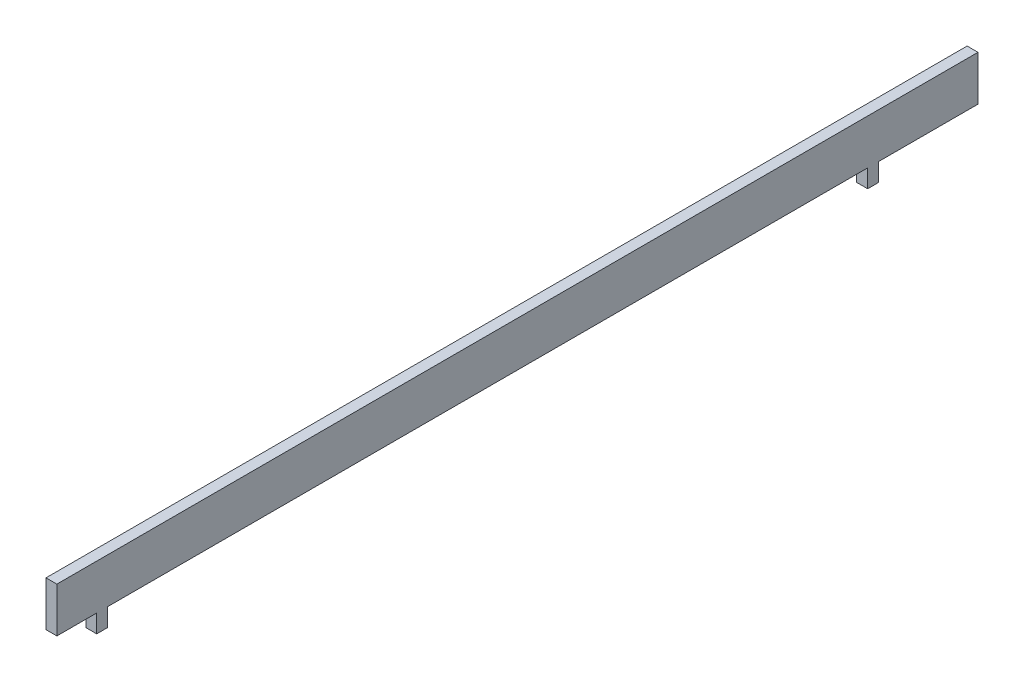
ISO-10303-21;
HEADER;
FILE_DESCRIPTION(('STEP AP214'),'2;1');
FILE_NAME('part.step','',(''),(''),'','','');
FILE_SCHEMA(('AUTOMOTIVE_DESIGN { 1 0 10303 214 1 1 1 1 }'));
ENDSEC;
DATA;
#1=APPLICATION_CONTEXT('core data for automotive mechanical design processes');
#2=APPLICATION_PROTOCOL_DEFINITION('international standard','automotive_design',2000,#1);
#3=PRODUCT_CONTEXT('',#1,'mechanical');
#4=PRODUCT('Part','Part','',(#3));
#5=PRODUCT_RELATED_PRODUCT_CATEGORY('part','',(#4));
#6=PRODUCT_DEFINITION_FORMATION('','',#4);
#7=PRODUCT_DEFINITION_CONTEXT('part definition',#1,'design');
#8=PRODUCT_DEFINITION('design','',#6,#7);
#9=PRODUCT_DEFINITION_SHAPE('','',#8);
#10=(LENGTH_UNIT() NAMED_UNIT(*) SI_UNIT(.MILLI.,.METRE.));
#11=(NAMED_UNIT(*) PLANE_ANGLE_UNIT() SI_UNIT($,.RADIAN.));
#12=(NAMED_UNIT(*) SI_UNIT($,.STERADIAN.) SOLID_ANGLE_UNIT());
#13=UNCERTAINTY_MEASURE_WITH_UNIT(LENGTH_MEASURE(1.E-05),#10,'distance_accuracy_value','');
#14=(GEOMETRIC_REPRESENTATION_CONTEXT(3) GLOBAL_UNCERTAINTY_ASSIGNED_CONTEXT((#13)) GLOBAL_UNIT_ASSIGNED_CONTEXT((#10,
#11,#12)) REPRESENTATION_CONTEXT('',''));
#15=CARTESIAN_POINT('',(0.,0.,0.));
#16=DIRECTION('',(0.,0.,1.));
#17=DIRECTION('',(1.,0.,0.));
#18=AXIS2_PLACEMENT_3D('',#15,#16,#17);
#19=CARTESIAN_POINT('',(1.5,76.,-320.));
#20=DIRECTION('',(0.,0.,-1.));
#21=DIRECTION('',(-1.,0.,0.));
#22=AXIS2_PLACEMENT_3D('',#19,#20,#21);
#23=PLANE('',#22);
#24=CARTESIAN_POINT('',(0.,0.,-320.));
#25=DIRECTION('',(0.,0.,1.));
#26=DIRECTION('',(1.,0.,0.));
#27=AXIS2_PLACEMENT_3D('',#24,#25,#26);
#28=CIRCLE('',#27,83.6);
#29=CARTESIAN_POINT('',(1.5,83.5865419789573,-320.));
#30=VERTEX_POINT('',#29);
#31=CARTESIAN_POINT('',(-1.5,83.5865419789573,-320.));
#32=VERTEX_POINT('',#31);
#33=EDGE_CURVE('E49',#30,#32,#28,.T.);
#34=ORIENTED_EDGE('',*,*,#33,.F.);
#35=DIRECTION('',(0.,-1.,0.));
#36=VECTOR('',#35,1.);
#37=CARTESIAN_POINT('',(1.5,76.,-320.));
#38=LINE('',#37,#36);
#39=CARTESIAN_POINT('',(1.5,96.,-320.));
#40=VERTEX_POINT('',#39);
#41=EDGE_CURVE('E81',#40,#30,#38,.T.);
#42=ORIENTED_EDGE('',*,*,#41,.F.);
#43=DIRECTION('',(-1.,0.,0.));
#44=VECTOR('',#43,1.);
#45=CARTESIAN_POINT('',(1.5,96.,-320.));
#46=LINE('',#45,#44);
#47=CARTESIAN_POINT('',(-1.5,96.,-320.));
#48=VERTEX_POINT('',#47);
#49=EDGE_CURVE('E74',#40,#48,#46,.T.);
#50=ORIENTED_EDGE('',*,*,#49,.T.);
#51=DIRECTION('',(0.,-1.,0.));
#52=VECTOR('',#51,1.);
#53=CARTESIAN_POINT('',(-1.5,76.,-320.));
#54=LINE('',#53,#52);
#55=EDGE_CURVE('E86',#48,#32,#54,.T.);
#56=ORIENTED_EDGE('',*,*,#55,.T.);
#57=EDGE_LOOP('',(#34,#42,#50,#56));
#58=FACE_BOUND('',#57,.T.);
#59=ADVANCED_FACE('F35',(#58),#23,.F.);
#60=CARTESIAN_POINT('',(1.5,76.,-574.5));
#61=DIRECTION('',(0.,0.,1.));
#62=DIRECTION('',(1.,0.,0.));
#63=AXIS2_PLACEMENT_3D('',#60,#61,#62);
#64=PLANE('',#63);
#65=CARTESIAN_POINT('',(0.,0.,-574.5));
#66=DIRECTION('',(0.,0.,1.));
#67=DIRECTION('',(1.,0.,0.));
#68=AXIS2_PLACEMENT_3D('',#65,#66,#67);
#69=CIRCLE('',#68,83.6);
#70=CARTESIAN_POINT('',(1.5,83.5865419789573,-574.5));
#71=VERTEX_POINT('',#70);
#72=CARTESIAN_POINT('',(-1.5,83.5865419789573,-574.5));
#73=VERTEX_POINT('',#72);
#74=EDGE_CURVE('E145',#71,#73,#69,.T.);
#75=ORIENTED_EDGE('',*,*,#74,.T.);
#76=DIRECTION('',(0.,1.,0.));
#77=VECTOR('',#76,1.);
#78=CARTESIAN_POINT('',(-1.5,76.,-574.5));
#79=LINE('',#78,#77);
#80=CARTESIAN_POINT('',(-1.5,96.,-574.5));
#81=VERTEX_POINT('',#80);
#82=EDGE_CURVE('E82',#73,#81,#79,.T.);
#83=ORIENTED_EDGE('',*,*,#82,.T.);
#84=DIRECTION('',(-1.,0.,0.));
#85=VECTOR('',#84,1.);
#86=CARTESIAN_POINT('',(1.5,96.,-574.5));
#87=LINE('',#86,#85);
#88=CARTESIAN_POINT('',(1.5,96.,-574.5));
#89=VERTEX_POINT('',#88);
#90=EDGE_CURVE('E77',#89,#81,#87,.T.);
#91=ORIENTED_EDGE('',*,*,#90,.F.);
#92=DIRECTION('',(0.,1.,0.));
#93=VECTOR('',#92,1.);
#94=CARTESIAN_POINT('',(1.5,76.,-574.5));
#95=LINE('',#94,#93);
#96=EDGE_CURVE('E173',#71,#89,#95,.T.);
#97=ORIENTED_EDGE('',*,*,#96,.F.);
#98=EDGE_LOOP('',(#75,#83,#91,#97));
#99=FACE_BOUND('',#98,.T.);
#100=ADVANCED_FACE('F177',(#99),#64,.F.);
#101=CARTESIAN_POINT('',(1.5,0.,0.));
#102=DIRECTION('',(-1.,0.,0.));
#103=DIRECTION('',(0.,0.,1.));
#104=AXIS2_PLACEMENT_3D('',#101,#102,#103);
#105=PLANE('',#104);
#106=DIRECTION('',(0.,0.,1.));
#107=VECTOR('',#106,1.);
#108=CARTESIAN_POINT('',(1.5,83.5865419789573,0.));
#109=LINE('',#108,#107);
#110=CARTESIAN_POINT('',(1.5,83.5865419789573,-547.));
#111=VERTEX_POINT('',#110);
#112=EDGE_CURVE('E91',#71,#111,#109,.T.);
#113=ORIENTED_EDGE('',*,*,#112,.F.);
#114=ORIENTED_EDGE('',*,*,#96,.T.);
#115=DIRECTION('',(0.,0.,1.));
#116=VECTOR('',#115,1.);
#117=CARTESIAN_POINT('',(1.5,96.,-320.));
#118=LINE('',#117,#116);
#119=EDGE_CURVE('E58',#89,#40,#118,.T.);
#120=ORIENTED_EDGE('',*,*,#119,.T.);
#121=ORIENTED_EDGE('',*,*,#41,.T.);
#122=DIRECTION('',(0.,0.,1.));
#123=VECTOR('',#122,1.);
#124=CARTESIAN_POINT('',(1.5,83.5865419789573,0.));
#125=LINE('',#124,#123);
#126=CARTESIAN_POINT('',(1.5,83.5865419789573,-331.));
#127=VERTEX_POINT('',#126);
#128=EDGE_CURVE('E147',#127,#30,#125,.T.);
#129=ORIENTED_EDGE('',*,*,#128,.F.);
#130=DIRECTION('',(0.,1.,0.));
#131=VECTOR('',#130,1.);
#132=CARTESIAN_POINT('',(1.5,0.,-331.));
#133=LINE('',#132,#131);
#134=CARTESIAN_POINT('',(1.5,78.5856857194744,-331.));
#135=VERTEX_POINT('',#134);
#136=EDGE_CURVE('E154',#135,#127,#133,.T.);
#137=ORIENTED_EDGE('',*,*,#136,.F.);
#138=DIRECTION('',(0.,0.,1.));
#139=VECTOR('',#138,1.);
#140=CARTESIAN_POINT('',(1.5,78.5856857194744,0.));
#141=LINE('',#140,#139);
#142=CARTESIAN_POINT('',(1.5,78.5856857194744,-334.));
#143=VERTEX_POINT('',#142);
#144=EDGE_CURVE('E157',#143,#135,#141,.T.);
#145=ORIENTED_EDGE('',*,*,#144,.F.);
#146=DIRECTION('',(0.,-1.,0.));
#147=VECTOR('',#146,1.);
#148=CARTESIAN_POINT('',(1.5,0.,-334.));
#149=LINE('',#148,#147);
#150=CARTESIAN_POINT('',(1.5,83.5865419789573,-334.));
#151=VERTEX_POINT('',#150);
#152=EDGE_CURVE('E160',#151,#143,#149,.T.);
#153=ORIENTED_EDGE('',*,*,#152,.F.);
#154=DIRECTION('',(0.,0.,1.));
#155=VECTOR('',#154,1.);
#156=CARTESIAN_POINT('',(1.5,83.5865419789573,0.));
#157=LINE('',#156,#155);
#158=CARTESIAN_POINT('',(1.5,83.5865419789573,-544.));
#159=VERTEX_POINT('',#158);
#160=EDGE_CURVE('E163',#159,#151,#157,.T.);
#161=ORIENTED_EDGE('',*,*,#160,.F.);
#162=DIRECTION('',(0.,1.,0.));
#163=VECTOR('',#162,1.);
#164=CARTESIAN_POINT('',(1.5,0.,-544.));
#165=LINE('',#164,#163);
#166=CARTESIAN_POINT('',(1.5,78.5856857194744,-544.));
#167=VERTEX_POINT('',#166);
#168=EDGE_CURVE('E166',#167,#159,#165,.T.);
#169=ORIENTED_EDGE('',*,*,#168,.F.);
#170=DIRECTION('',(0.,0.,1.));
#171=VECTOR('',#170,1.);
#172=CARTESIAN_POINT('',(1.5,78.5856857194744,0.));
#173=LINE('',#172,#171);
#174=CARTESIAN_POINT('',(1.5,78.5856857194744,-547.));
#175=VERTEX_POINT('',#174);
#176=EDGE_CURVE('E169',#175,#167,#173,.T.);
#177=ORIENTED_EDGE('',*,*,#176,.F.);
#178=DIRECTION('',(0.,-1.,0.));
#179=VECTOR('',#178,1.);
#180=CARTESIAN_POINT('',(1.5,0.,-547.));
#181=LINE('',#180,#179);
#182=EDGE_CURVE('E95',#111,#175,#181,.T.);
#183=ORIENTED_EDGE('',*,*,#182,.F.);
#184=EDGE_LOOP('',(#113,#114,#120,#121,#129,#137,#145,#153,#161,#169,#177,#183));
#185=FACE_BOUND('',#184,.T.);
#186=ADVANCED_FACE('F175',(#185),#105,.F.);
#187=CARTESIAN_POINT('',(-1.5,0.,0.));
#188=DIRECTION('',(-1.,0.,0.));
#189=DIRECTION('',(0.,0.,1.));
#190=AXIS2_PLACEMENT_3D('',#187,#188,#189);
#191=PLANE('',#190);
#192=ORIENTED_EDGE('',*,*,#82,.F.);
#193=DIRECTION('',(0.,0.,1.));
#194=VECTOR('',#193,1.);
#195=CARTESIAN_POINT('',(-1.5,83.5865419789573,0.));
#196=LINE('',#195,#194);
#197=CARTESIAN_POINT('',(-1.5,83.5865419789573,-547.));
#198=VERTEX_POINT('',#197);
#199=EDGE_CURVE('E11',#73,#198,#196,.T.);
#200=ORIENTED_EDGE('',*,*,#199,.T.);
#201=DIRECTION('',(0.,-1.,0.));
#202=VECTOR('',#201,1.);
#203=CARTESIAN_POINT('',(-1.5,0.,-547.));
#204=LINE('',#203,#202);
#205=CARTESIAN_POINT('',(-1.5,78.5856857194744,-547.));
#206=VERTEX_POINT('',#205);
#207=EDGE_CURVE('E42',#198,#206,#204,.T.);
#208=ORIENTED_EDGE('',*,*,#207,.T.);
#209=DIRECTION('',(0.,0.,1.));
#210=VECTOR('',#209,1.);
#211=CARTESIAN_POINT('',(-1.5,78.5856857194744,0.));
#212=LINE('',#211,#210);
#213=CARTESIAN_POINT('',(-1.5,78.5856857194744,-544.));
#214=VERTEX_POINT('',#213);
#215=EDGE_CURVE('E116',#206,#214,#212,.T.);
#216=ORIENTED_EDGE('',*,*,#215,.T.);
#217=DIRECTION('',(0.,1.,0.));
#218=VECTOR('',#217,1.);
#219=CARTESIAN_POINT('',(-1.5,0.,-544.));
#220=LINE('',#219,#218);
#221=CARTESIAN_POINT('',(-1.5,83.5865419789573,-544.));
#222=VERTEX_POINT('',#221);
#223=EDGE_CURVE('E113',#214,#222,#220,.T.);
#224=ORIENTED_EDGE('',*,*,#223,.T.);
#225=DIRECTION('',(0.,0.,1.));
#226=VECTOR('',#225,1.);
#227=CARTESIAN_POINT('',(-1.5,83.5865419789573,0.));
#228=LINE('',#227,#226);
#229=CARTESIAN_POINT('',(-1.5,83.5865419789573,-334.));
#230=VERTEX_POINT('',#229);
#231=EDGE_CURVE('E110',#222,#230,#228,.T.);
#232=ORIENTED_EDGE('',*,*,#231,.T.);
#233=DIRECTION('',(0.,-1.,0.));
#234=VECTOR('',#233,1.);
#235=CARTESIAN_POINT('',(-1.5,0.,-334.));
#236=LINE('',#235,#234);
#237=CARTESIAN_POINT('',(-1.5,78.5856857194744,-334.));
#238=VERTEX_POINT('',#237);
#239=EDGE_CURVE('E107',#230,#238,#236,.T.);
#240=ORIENTED_EDGE('',*,*,#239,.T.);
#241=DIRECTION('',(0.,0.,1.));
#242=VECTOR('',#241,1.);
#243=CARTESIAN_POINT('',(-1.5,78.5856857194744,0.));
#244=LINE('',#243,#242);
#245=CARTESIAN_POINT('',(-1.5,78.5856857194744,-331.));
#246=VERTEX_POINT('',#245);
#247=EDGE_CURVE('E104',#238,#246,#244,.T.);
#248=ORIENTED_EDGE('',*,*,#247,.T.);
#249=DIRECTION('',(0.,1.,0.));
#250=VECTOR('',#249,1.);
#251=CARTESIAN_POINT('',(-1.5,0.,-331.));
#252=LINE('',#251,#250);
#253=CARTESIAN_POINT('',(-1.5,83.5865419789573,-331.));
#254=VERTEX_POINT('',#253);
#255=EDGE_CURVE('E102',#246,#254,#252,.T.);
#256=ORIENTED_EDGE('',*,*,#255,.T.);
#257=DIRECTION('',(0.,0.,1.));
#258=VECTOR('',#257,1.);
#259=CARTESIAN_POINT('',(-1.5,83.5865419789573,0.));
#260=LINE('',#259,#258);
#261=EDGE_CURVE('E90',#254,#32,#260,.T.);
#262=ORIENTED_EDGE('',*,*,#261,.T.);
#263=ORIENTED_EDGE('',*,*,#55,.F.);
#264=DIRECTION('',(0.,0.,1.));
#265=VECTOR('',#264,1.);
#266=CARTESIAN_POINT('',(-1.5,96.,-320.));
#267=LINE('',#266,#265);
#268=EDGE_CURVE('E71',#81,#48,#267,.T.);
#269=ORIENTED_EDGE('',*,*,#268,.F.);
#270=EDGE_LOOP('',(#192,#200,#208,#216,#224,#232,#240,#248,#256,#262,#263,#269));
#271=FACE_BOUND('',#270,.T.);
#272=ADVANCED_FACE('F88',(#271),#191,.T.);
#273=CARTESIAN_POINT('',(1.5,96.,-320.));
#274=DIRECTION('',(0.,-1.,0.));
#275=DIRECTION('',(0.,0.,-1.));
#276=AXIS2_PLACEMENT_3D('',#273,#274,#275);
#277=PLANE('',#276);
#278=ORIENTED_EDGE('',*,*,#268,.T.);
#279=ORIENTED_EDGE('',*,*,#49,.F.);
#280=ORIENTED_EDGE('',*,*,#119,.F.);
#281=ORIENTED_EDGE('',*,*,#90,.T.);
#282=EDGE_LOOP('',(#278,#279,#280,#281));
#283=FACE_BOUND('',#282,.T.);
#284=ADVANCED_FACE('F73',(#283),#277,.F.);
#285=CARTESIAN_POINT('',(0.,0.,0.));
#286=DIRECTION('',(0.,0.,1.));
#287=DIRECTION('',(1.,0.,0.));
#288=AXIS2_PLACEMENT_3D('',#285,#286,#287);
#289=CYLINDRICAL_SURFACE('',#288,83.6);
#290=ORIENTED_EDGE('',*,*,#112,.T.);
#291=CARTESIAN_POINT('',(0.,0.,-547.));
#292=DIRECTION('',(0.,0.,1.));
#293=DIRECTION('',(1.,0.,0.));
#294=AXIS2_PLACEMENT_3D('',#291,#292,#293);
#295=CIRCLE('',#294,83.6);
#296=EDGE_CURVE('E134',#111,#198,#295,.T.);
#297=ORIENTED_EDGE('',*,*,#296,.T.);
#298=ORIENTED_EDGE('',*,*,#199,.F.);
#299=ORIENTED_EDGE('',*,*,#74,.F.);
#300=EDGE_LOOP('',(#290,#297,#298,#299));
#301=FACE_BOUND('',#300,.T.);
#302=ADVANCED_FACE('F141',(#301),#289,.F.);
#303=CARTESIAN_POINT('',(5.83775679854572E-13,-83.6,-547.));
#304=DIRECTION('',(0.,0.,-1.));
#305=DIRECTION('',(-1.,0.,0.));
#306=AXIS2_PLACEMENT_3D('',#303,#304,#305);
#307=PLANE('',#306);
#308=ORIENTED_EDGE('',*,*,#182,.T.);
#309=CARTESIAN_POINT('',(0.,0.,-547.));
#310=DIRECTION('',(0.,0.,1.));
#311=DIRECTION('',(1.,0.,0.));
#312=AXIS2_PLACEMENT_3D('',#309,#310,#311);
#313=CIRCLE('',#312,78.6);
#314=EDGE_CURVE('E137',#175,#206,#313,.T.);
#315=ORIENTED_EDGE('',*,*,#314,.T.);
#316=ORIENTED_EDGE('',*,*,#207,.F.);
#317=ORIENTED_EDGE('',*,*,#296,.F.);
#318=EDGE_LOOP('',(#308,#315,#316,#317));
#319=FACE_BOUND('',#318,.T.);
#320=ADVANCED_FACE('F133',(#319),#307,.T.);
#321=CARTESIAN_POINT('',(0.,0.,0.));
#322=DIRECTION('',(0.,0.,1.));
#323=DIRECTION('',(1.,0.,0.));
#324=AXIS2_PLACEMENT_3D('',#321,#322,#323);
#325=CYLINDRICAL_SURFACE('',#324,78.6);
#326=ORIENTED_EDGE('',*,*,#176,.T.);
#327=CARTESIAN_POINT('',(0.,0.,-544.));
#328=DIRECTION('',(0.,0.,1.));
#329=DIRECTION('',(1.,0.,0.));
#330=AXIS2_PLACEMENT_3D('',#327,#328,#329);
#331=CIRCLE('',#330,78.6);
#332=EDGE_CURVE('E149',#167,#214,#331,.T.);
#333=ORIENTED_EDGE('',*,*,#332,.T.);
#334=ORIENTED_EDGE('',*,*,#215,.F.);
#335=ORIENTED_EDGE('',*,*,#314,.F.);
#336=EDGE_LOOP('',(#326,#333,#334,#335));
#337=FACE_BOUND('',#336,.T.);
#338=ADVANCED_FACE('F234',(#337),#325,.F.);
#339=CARTESIAN_POINT('',(5.83775679854572E-13,-83.6,-544.));
#340=DIRECTION('',(0.,0.,1.));
#341=DIRECTION('',(1.,0.,0.));
#342=AXIS2_PLACEMENT_3D('',#339,#340,#341);
#343=PLANE('',#342);
#344=ORIENTED_EDGE('',*,*,#168,.T.);
#345=CARTESIAN_POINT('',(0.,0.,-544.));
#346=DIRECTION('',(0.,0.,1.));
#347=DIRECTION('',(1.,0.,0.));
#348=AXIS2_PLACEMENT_3D('',#345,#346,#347);
#349=CIRCLE('',#348,83.6);
#350=EDGE_CURVE('E229',#159,#222,#349,.T.);
#351=ORIENTED_EDGE('',*,*,#350,.T.);
#352=ORIENTED_EDGE('',*,*,#223,.F.);
#353=ORIENTED_EDGE('',*,*,#332,.F.);
#354=EDGE_LOOP('',(#344,#351,#352,#353));
#355=FACE_BOUND('',#354,.T.);
#356=ADVANCED_FACE('F238',(#355),#343,.T.);
#357=CARTESIAN_POINT('',(0.,0.,0.));
#358=DIRECTION('',(0.,0.,1.));
#359=DIRECTION('',(1.,0.,0.));
#360=AXIS2_PLACEMENT_3D('',#357,#358,#359);
#361=CYLINDRICAL_SURFACE('',#360,83.6);
#362=ORIENTED_EDGE('',*,*,#160,.T.);
#363=CARTESIAN_POINT('',(0.,0.,-334.));
#364=DIRECTION('',(0.,0.,1.));
#365=DIRECTION('',(1.,0.,0.));
#366=AXIS2_PLACEMENT_3D('',#363,#364,#365);
#367=CIRCLE('',#366,83.6);
#368=EDGE_CURVE('E226',#151,#230,#367,.T.);
#369=ORIENTED_EDGE('',*,*,#368,.T.);
#370=ORIENTED_EDGE('',*,*,#231,.F.);
#371=ORIENTED_EDGE('',*,*,#350,.F.);
#372=EDGE_LOOP('',(#362,#369,#370,#371));
#373=FACE_BOUND('',#372,.T.);
#374=ADVANCED_FACE('F245',(#373),#361,.F.);
#375=CARTESIAN_POINT('',(5.4886086646614E-13,-78.6,-334.));
#376=DIRECTION('',(0.,0.,-1.));
#377=DIRECTION('',(-1.,0.,0.));
#378=AXIS2_PLACEMENT_3D('',#375,#376,#377);
#379=PLANE('',#378);
#380=ORIENTED_EDGE('',*,*,#152,.T.);
#381=CARTESIAN_POINT('',(0.,0.,-334.));
#382=DIRECTION('',(0.,0.,1.));
#383=DIRECTION('',(1.,0.,0.));
#384=AXIS2_PLACEMENT_3D('',#381,#382,#383);
#385=CIRCLE('',#384,78.6);
#386=EDGE_CURVE('E223',#143,#238,#385,.T.);
#387=ORIENTED_EDGE('',*,*,#386,.T.);
#388=ORIENTED_EDGE('',*,*,#239,.F.);
#389=ORIENTED_EDGE('',*,*,#368,.F.);
#390=EDGE_LOOP('',(#380,#387,#388,#389));
#391=FACE_BOUND('',#390,.T.);
#392=ADVANCED_FACE('F247',(#391),#379,.T.);
#393=CARTESIAN_POINT('',(0.,0.,0.));
#394=DIRECTION('',(0.,0.,1.));
#395=DIRECTION('',(1.,0.,0.));
#396=AXIS2_PLACEMENT_3D('',#393,#394,#395);
#397=CYLINDRICAL_SURFACE('',#396,78.6);
#398=ORIENTED_EDGE('',*,*,#144,.T.);
#399=CARTESIAN_POINT('',(0.,0.,-331.));
#400=DIRECTION('',(0.,0.,1.));
#401=DIRECTION('',(1.,0.,0.));
#402=AXIS2_PLACEMENT_3D('',#399,#400,#401);
#403=CIRCLE('',#402,78.6);
#404=EDGE_CURVE('E218',#135,#246,#403,.T.);
#405=ORIENTED_EDGE('',*,*,#404,.T.);
#406=ORIENTED_EDGE('',*,*,#247,.F.);
#407=ORIENTED_EDGE('',*,*,#386,.F.);
#408=EDGE_LOOP('',(#398,#405,#406,#407));
#409=FACE_BOUND('',#408,.T.);
#410=ADVANCED_FACE('F250',(#409),#397,.F.);
#411=CARTESIAN_POINT('',(5.83775679854572E-13,-83.6,-331.));
#412=DIRECTION('',(0.,0.,1.));
#413=DIRECTION('',(1.,0.,0.));
#414=AXIS2_PLACEMENT_3D('',#411,#412,#413);
#415=PLANE('',#414);
#416=ORIENTED_EDGE('',*,*,#136,.T.);
#417=CARTESIAN_POINT('',(0.,0.,-331.));
#418=DIRECTION('',(0.,0.,1.));
#419=DIRECTION('',(1.,0.,0.));
#420=AXIS2_PLACEMENT_3D('',#417,#418,#419);
#421=CIRCLE('',#420,83.6);
#422=EDGE_CURVE('E215',#127,#254,#421,.T.);
#423=ORIENTED_EDGE('',*,*,#422,.T.);
#424=ORIENTED_EDGE('',*,*,#255,.F.);
#425=ORIENTED_EDGE('',*,*,#404,.F.);
#426=EDGE_LOOP('',(#416,#423,#424,#425));
#427=FACE_BOUND('',#426,.T.);
#428=ADVANCED_FACE('F253',(#427),#415,.T.);
#429=CARTESIAN_POINT('',(0.,0.,0.));
#430=DIRECTION('',(0.,0.,1.));
#431=DIRECTION('',(1.,0.,0.));
#432=AXIS2_PLACEMENT_3D('',#429,#430,#431);
#433=CYLINDRICAL_SURFACE('',#432,83.6);
#434=ORIENTED_EDGE('',*,*,#128,.T.);
#435=ORIENTED_EDGE('',*,*,#33,.T.);
#436=ORIENTED_EDGE('',*,*,#261,.F.);
#437=ORIENTED_EDGE('',*,*,#422,.F.);
#438=EDGE_LOOP('',(#434,#435,#436,#437));
#439=FACE_BOUND('',#438,.T.);
#440=ADVANCED_FACE('F213',(#439),#433,.F.);
#441=CLOSED_SHELL('',(#59,#100,#186,#272,#284,#302,#320,#338,#356,#374,#392,#410,#428,#440));
#442=MANIFOLD_SOLID_BREP('B2',#441);
#443=ADVANCED_BREP_SHAPE_REPRESENTATION('',(#18,#442),#14);
#444=SHAPE_DEFINITION_REPRESENTATION(#9,#443);
ENDSEC;
END-ISO-10303-21;
